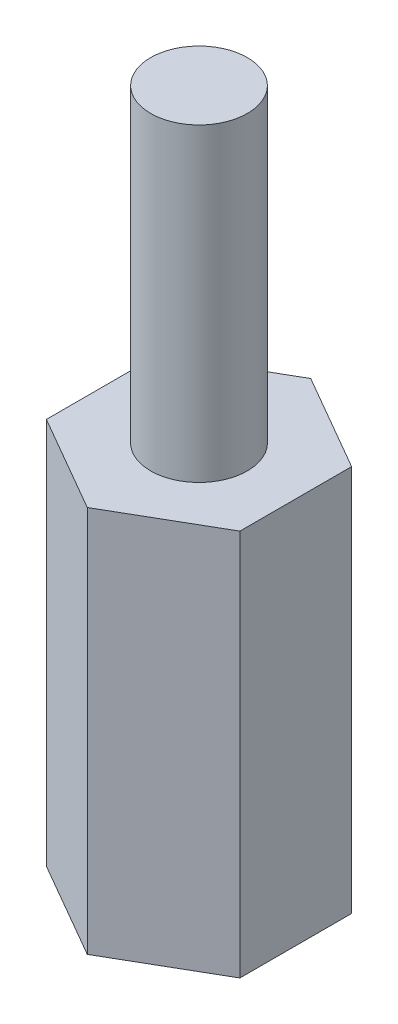
ISO-10303-21;
HEADER;
FILE_DESCRIPTION(('STEP AP214'),'2;1');
FILE_NAME('part.step','',(''),(''),'','','');
FILE_SCHEMA(('AUTOMOTIVE_DESIGN { 1 0 10303 214 1 1 1 1 }'));
ENDSEC;
DATA;
#1=APPLICATION_CONTEXT('core data for automotive mechanical design processes');
#2=APPLICATION_PROTOCOL_DEFINITION('international standard','automotive_design',2000,#1);
#3=PRODUCT_CONTEXT('',#1,'mechanical');
#4=PRODUCT('Part','Part','',(#3));
#5=PRODUCT_RELATED_PRODUCT_CATEGORY('part','',(#4));
#6=PRODUCT_DEFINITION_FORMATION('','',#4);
#7=PRODUCT_DEFINITION_CONTEXT('part definition',#1,'design');
#8=PRODUCT_DEFINITION('design','',#6,#7);
#9=PRODUCT_DEFINITION_SHAPE('','',#8);
#10=(LENGTH_UNIT() NAMED_UNIT(*) SI_UNIT(.MILLI.,.METRE.));
#11=(NAMED_UNIT(*) PLANE_ANGLE_UNIT() SI_UNIT($,.RADIAN.));
#12=(NAMED_UNIT(*) SI_UNIT($,.STERADIAN.) SOLID_ANGLE_UNIT());
#13=UNCERTAINTY_MEASURE_WITH_UNIT(LENGTH_MEASURE(1.E-05),#10,'distance_accuracy_value','');
#14=(GEOMETRIC_REPRESENTATION_CONTEXT(3) GLOBAL_UNCERTAINTY_ASSIGNED_CONTEXT((#13)) GLOBAL_UNIT_ASSIGNED_CONTEXT((#10,
#11,#12)) REPRESENTATION_CONTEXT('',''));
#15=CARTESIAN_POINT('',(0.,0.,0.));
#16=DIRECTION('',(0.,0.,1.));
#17=DIRECTION('',(1.,0.,0.));
#18=AXIS2_PLACEMENT_3D('',#15,#16,#17);
#19=CARTESIAN_POINT('',(2.49999999999999,10.,-1.4433756729741));
#20=DIRECTION('',(-0.499999999999995,0.,0.866025403784442));
#21=DIRECTION('',(0.866025403784442,0.,0.499999999999995));
#22=AXIS2_PLACEMENT_3D('',#19,#20,#21);
#23=PLANE('',#22);
#24=DIRECTION('',(-0.866025403784442,0.,-0.499999999999995));
#25=VECTOR('',#24,1.);
#26=CARTESIAN_POINT('',(2.49999999999999,0.,-1.4433756729741));
#27=LINE('',#26,#25);
#28=CARTESIAN_POINT('',(2.49999999999999,0.,-1.4433756729741));
#29=VERTEX_POINT('',#28);
#30=CARTESIAN_POINT('',(0.,0.,-2.88675134594814));
#31=VERTEX_POINT('',#30);
#32=EDGE_CURVE('E130',#29,#31,#27,.T.);
#33=ORIENTED_EDGE('',*,*,#32,.T.);
#34=DIRECTION('',(0.,-1.,0.));
#35=VECTOR('',#34,1.);
#36=CARTESIAN_POINT('',(0.,10.,-2.88675134594814));
#37=LINE('',#36,#35);
#38=CARTESIAN_POINT('',(0.,10.,-2.88675134594814));
#39=VERTEX_POINT('',#38);
#40=EDGE_CURVE('E42',#39,#31,#37,.T.);
#41=ORIENTED_EDGE('',*,*,#40,.F.);
#42=DIRECTION('',(-0.866025403784442,0.,-0.499999999999995));
#43=VECTOR('',#42,1.);
#44=CARTESIAN_POINT('',(2.49999999999999,10.,-1.4433756729741));
#45=LINE('',#44,#43);
#46=CARTESIAN_POINT('',(2.49999999999999,10.,-1.4433756729741));
#47=VERTEX_POINT('',#46);
#48=EDGE_CURVE('E147',#47,#39,#45,.T.);
#49=ORIENTED_EDGE('',*,*,#48,.F.);
#50=DIRECTION('',(0.,-1.,0.));
#51=VECTOR('',#50,1.);
#52=CARTESIAN_POINT('',(2.49999999999999,10.,-1.4433756729741));
#53=LINE('',#52,#51);
#54=EDGE_CURVE('E126',#47,#29,#53,.T.);
#55=ORIENTED_EDGE('',*,*,#54,.T.);
#56=EDGE_LOOP('',(#33,#41,#49,#55));
#57=FACE_BOUND('',#56,.T.);
#58=ADVANCED_FACE('F39',(#57),#23,.F.);
#59=CARTESIAN_POINT('',(0.,10.,-2.88675134594814));
#60=DIRECTION('',(0.500000000000001,0.,0.866025403784438));
#61=DIRECTION('',(0.866025403784438,0.,-0.500000000000001));
#62=AXIS2_PLACEMENT_3D('',#59,#60,#61);
#63=PLANE('',#62);
#64=DIRECTION('',(-0.866025403784438,0.,0.500000000000001));
#65=VECTOR('',#64,1.);
#66=CARTESIAN_POINT('',(0.,0.,-2.88675134594814));
#67=LINE('',#66,#65);
#68=CARTESIAN_POINT('',(-2.50000000000001,0.,-1.44337567297406));
#69=VERTEX_POINT('',#68);
#70=EDGE_CURVE('E134',#31,#69,#67,.T.);
#71=ORIENTED_EDGE('',*,*,#70,.T.);
#72=DIRECTION('',(0.,-1.,0.));
#73=VECTOR('',#72,1.);
#74=CARTESIAN_POINT('',(-2.50000000000001,10.,-1.44337567297406));
#75=LINE('',#74,#73);
#76=CARTESIAN_POINT('',(-2.50000000000001,10.,-1.44337567297406));
#77=VERTEX_POINT('',#76);
#78=EDGE_CURVE('E153',#77,#69,#75,.T.);
#79=ORIENTED_EDGE('',*,*,#78,.F.);
#80=DIRECTION('',(-0.866025403784438,0.,0.500000000000001));
#81=VECTOR('',#80,1.);
#82=CARTESIAN_POINT('',(0.,10.,-2.88675134594814));
#83=LINE('',#82,#81);
#84=EDGE_CURVE('E95',#39,#77,#83,.T.);
#85=ORIENTED_EDGE('',*,*,#84,.F.);
#86=ORIENTED_EDGE('',*,*,#40,.T.);
#87=EDGE_LOOP('',(#71,#79,#85,#86));
#88=FACE_BOUND('',#87,.T.);
#89=ADVANCED_FACE('F160',(#88),#63,.F.);
#90=CARTESIAN_POINT('',(-2.50000000000001,10.,-1.44337567297406));
#91=DIRECTION('',(1.,0.,0.));
#92=DIRECTION('',(0.,0.,-1.));
#93=AXIS2_PLACEMENT_3D('',#90,#91,#92);
#94=PLANE('',#93);
#95=DIRECTION('',(0.,0.,1.));
#96=VECTOR('',#95,1.);
#97=CARTESIAN_POINT('',(-2.50000000000001,0.,-1.44337567297406));
#98=LINE('',#97,#96);
#99=CARTESIAN_POINT('',(-2.5,0.,1.44337567297408));
#100=VERTEX_POINT('',#99);
#101=EDGE_CURVE('E138',#69,#100,#98,.T.);
#102=ORIENTED_EDGE('',*,*,#101,.T.);
#103=DIRECTION('',(0.,-1.,0.));
#104=VECTOR('',#103,1.);
#105=CARTESIAN_POINT('',(-2.5,10.,1.44337567297408));
#106=LINE('',#105,#104);
#107=CARTESIAN_POINT('',(-2.5,10.,1.44337567297408));
#108=VERTEX_POINT('',#107);
#109=EDGE_CURVE('E119',#108,#100,#106,.T.);
#110=ORIENTED_EDGE('',*,*,#109,.F.);
#111=DIRECTION('',(0.,0.,1.));
#112=VECTOR('',#111,1.);
#113=CARTESIAN_POINT('',(-2.50000000000001,10.,-1.44337567297406));
#114=LINE('',#113,#112);
#115=EDGE_CURVE('E108',#77,#108,#114,.T.);
#116=ORIENTED_EDGE('',*,*,#115,.F.);
#117=ORIENTED_EDGE('',*,*,#78,.T.);
#118=EDGE_LOOP('',(#102,#110,#116,#117));
#119=FACE_BOUND('',#118,.T.);
#120=ADVANCED_FACE('F166',(#119),#94,.F.);
#121=CARTESIAN_POINT('',(-2.5,10.,1.44337567297408));
#122=DIRECTION('',(0.499999999999995,0.,-0.866025403784442));
#123=DIRECTION('',(-0.866025403784442,0.,-0.499999999999995));
#124=AXIS2_PLACEMENT_3D('',#121,#122,#123);
#125=PLANE('',#124);
#126=DIRECTION('',(0.866025403784442,0.,0.499999999999995));
#127=VECTOR('',#126,1.);
#128=CARTESIAN_POINT('',(-2.5,0.,1.44337567297408));
#129=LINE('',#128,#127);
#130=CARTESIAN_POINT('',(0.,0.,2.88675134594814));
#131=VERTEX_POINT('',#130);
#132=EDGE_CURVE('E117',#100,#131,#129,.T.);
#133=ORIENTED_EDGE('',*,*,#132,.T.);
#134=DIRECTION('',(0.,-1.,0.));
#135=VECTOR('',#134,1.);
#136=CARTESIAN_POINT('',(0.,10.,2.88675134594814));
#137=LINE('',#136,#135);
#138=CARTESIAN_POINT('',(0.,10.,2.88675134594814));
#139=VERTEX_POINT('',#138);
#140=EDGE_CURVE('E114',#139,#131,#137,.T.);
#141=ORIENTED_EDGE('',*,*,#140,.F.);
#142=DIRECTION('',(0.866025403784442,0.,0.499999999999995));
#143=VECTOR('',#142,1.);
#144=CARTESIAN_POINT('',(-2.5,10.,1.44337567297408));
#145=LINE('',#144,#143);
#146=EDGE_CURVE('E102',#108,#139,#145,.T.);
#147=ORIENTED_EDGE('',*,*,#146,.F.);
#148=ORIENTED_EDGE('',*,*,#109,.T.);
#149=EDGE_LOOP('',(#133,#141,#147,#148));
#150=FACE_BOUND('',#149,.T.);
#151=ADVANCED_FACE('F115',(#150),#125,.F.);
#152=CARTESIAN_POINT('',(0.,10.,2.88675134594814));
#153=DIRECTION('',(-0.500000000000007,0.,-0.866025403784435));
#154=DIRECTION('',(-0.866025403784435,0.,0.500000000000007));
#155=AXIS2_PLACEMENT_3D('',#152,#153,#154);
#156=PLANE('',#155);
#157=DIRECTION('',(0.866025403784435,0.,-0.500000000000007));
#158=VECTOR('',#157,1.);
#159=CARTESIAN_POINT('',(0.,0.,2.88675134594814));
#160=LINE('',#159,#158);
#161=CARTESIAN_POINT('',(2.50000000000002,0.,1.44337567297405));
#162=VERTEX_POINT('',#161);
#163=EDGE_CURVE('E80',#131,#162,#160,.T.);
#164=ORIENTED_EDGE('',*,*,#163,.T.);
#165=DIRECTION('',(0.,-1.,0.));
#166=VECTOR('',#165,1.);
#167=CARTESIAN_POINT('',(2.50000000000002,10.,1.44337567297405));
#168=LINE('',#167,#166);
#169=CARTESIAN_POINT('',(2.50000000000002,10.,1.44337567297405));
#170=VERTEX_POINT('',#169);
#171=EDGE_CURVE('E120',#170,#162,#168,.T.);
#172=ORIENTED_EDGE('',*,*,#171,.F.);
#173=DIRECTION('',(0.866025403784435,0.,-0.500000000000007));
#174=VECTOR('',#173,1.);
#175=CARTESIAN_POINT('',(0.,10.,2.88675134594814));
#176=LINE('',#175,#174);
#177=EDGE_CURVE('E106',#139,#170,#176,.T.);
#178=ORIENTED_EDGE('',*,*,#177,.F.);
#179=ORIENTED_EDGE('',*,*,#140,.T.);
#180=EDGE_LOOP('',(#164,#172,#178,#179));
#181=FACE_BOUND('',#180,.T.);
#182=ADVANCED_FACE('F122',(#181),#156,.F.);
#183=CARTESIAN_POINT('',(2.50000000000002,10.,1.44337567297405));
#184=DIRECTION('',(-1.,0.,0.));
#185=DIRECTION('',(0.,0.,1.));
#186=AXIS2_PLACEMENT_3D('',#183,#184,#185);
#187=PLANE('',#186);
#188=DIRECTION('',(0.,0.,-1.));
#189=VECTOR('',#188,1.);
#190=CARTESIAN_POINT('',(2.50000000000002,0.,1.44337567297405));
#191=LINE('',#190,#189);
#192=EDGE_CURVE('E86',#162,#29,#191,.T.);
#193=ORIENTED_EDGE('',*,*,#192,.T.);
#194=ORIENTED_EDGE('',*,*,#54,.F.);
#195=DIRECTION('',(0.,0.,-1.));
#196=VECTOR('',#195,1.);
#197=CARTESIAN_POINT('',(2.50000000000002,10.,1.44337567297405));
#198=LINE('',#197,#196);
#199=EDGE_CURVE('E57',#170,#47,#198,.T.);
#200=ORIENTED_EDGE('',*,*,#199,.F.);
#201=ORIENTED_EDGE('',*,*,#171,.T.);
#202=EDGE_LOOP('',(#193,#194,#200,#201));
#203=FACE_BOUND('',#202,.T.);
#204=ADVANCED_FACE('F203',(#203),#187,.F.);
#205=CARTESIAN_POINT('',(0.,10.,0.));
#206=DIRECTION('',(0.,1.,0.));
#207=DIRECTION('',(0.,0.,1.));
#208=AXIS2_PLACEMENT_3D('',#205,#206,#207);
#209=PLANE('',#208);
#210=CARTESIAN_POINT('',(0.,10.,0.));
#211=DIRECTION('',(0.,1.,0.));
#212=DIRECTION('',(0.,0.,1.));
#213=AXIS2_PLACEMENT_3D('',#210,#211,#212);
#214=CIRCLE('',#213,1.25);
#215=CARTESIAN_POINT('',(0.,10.,1.25));
#216=VERTEX_POINT('',#215);
#217=EDGE_CURVE('E11',#216,#216,#214,.T.);
#218=ORIENTED_EDGE('',*,*,#217,.F.);
#219=EDGE_LOOP('',(#218));
#220=FACE_BOUND('',#219,.T.);
#221=ORIENTED_EDGE('',*,*,#48,.T.);
#222=ORIENTED_EDGE('',*,*,#84,.T.);
#223=ORIENTED_EDGE('',*,*,#115,.T.);
#224=ORIENTED_EDGE('',*,*,#146,.T.);
#225=ORIENTED_EDGE('',*,*,#177,.T.);
#226=ORIENTED_EDGE('',*,*,#199,.T.);
#227=EDGE_LOOP('',(#221,#222,#223,#224,#225,#226));
#228=FACE_BOUND('',#227,.T.);
#229=ADVANCED_FACE('F104',(#220,#228),#209,.T.);
#230=CARTESIAN_POINT('',(0.,0.,0.));
#231=DIRECTION('',(0.,1.,0.));
#232=DIRECTION('',(0.,0.,1.));
#233=AXIS2_PLACEMENT_3D('',#230,#231,#232);
#234=PLANE('',#233);
#235=CARTESIAN_POINT('',(0.,0.,0.));
#236=DIRECTION('',(0.,-1.,0.));
#237=DIRECTION('',(0.,0.,-1.));
#238=AXIS2_PLACEMENT_3D('',#235,#236,#237);
#239=CIRCLE('',#238,1.25);
#240=CARTESIAN_POINT('',(0.,0.,-1.25));
#241=VERTEX_POINT('',#240);
#242=EDGE_CURVE('E177',#241,#241,#239,.T.);
#243=ORIENTED_EDGE('',*,*,#242,.F.);
#244=EDGE_LOOP('',(#243));
#245=FACE_BOUND('',#244,.T.);
#246=ORIENTED_EDGE('',*,*,#32,.F.);
#247=ORIENTED_EDGE('',*,*,#192,.F.);
#248=ORIENTED_EDGE('',*,*,#163,.F.);
#249=ORIENTED_EDGE('',*,*,#132,.F.);
#250=ORIENTED_EDGE('',*,*,#101,.F.);
#251=ORIENTED_EDGE('',*,*,#70,.F.);
#252=EDGE_LOOP('',(#246,#247,#248,#249,#250,#251));
#253=FACE_BOUND('',#252,.T.);
#254=ADVANCED_FACE('F165',(#245,#253),#234,.F.);
#255=CARTESIAN_POINT('',(0.,18.,0.));
#256=DIRECTION('',(0.,-1.,0.));
#257=DIRECTION('',(0.,0.,-1.));
#258=AXIS2_PLACEMENT_3D('',#255,#256,#257);
#259=CYLINDRICAL_SURFACE('',#258,1.25);
#260=CARTESIAN_POINT('',(0.,18.,0.));
#261=DIRECTION('',(0.,1.,0.));
#262=DIRECTION('',(0.,0.,1.));
#263=AXIS2_PLACEMENT_3D('',#260,#261,#262);
#264=CIRCLE('',#263,1.25);
#265=CARTESIAN_POINT('',(0.,18.,1.25));
#266=VERTEX_POINT('',#265);
#267=EDGE_CURVE('E135',#266,#266,#264,.T.);
#268=ORIENTED_EDGE('',*,*,#267,.F.);
#269=EDGE_LOOP('',(#268));
#270=FACE_BOUND('',#269,.T.);
#271=ORIENTED_EDGE('',*,*,#217,.T.);
#272=EDGE_LOOP('',(#271));
#273=FACE_BOUND('',#272,.T.);
#274=ADVANCED_FACE('F195',(#270,#273),#259,.T.);
#275=CARTESIAN_POINT('',(0.,18.,0.));
#276=DIRECTION('',(0.,1.,0.));
#277=DIRECTION('',(0.,0.,1.));
#278=AXIS2_PLACEMENT_3D('',#275,#276,#277);
#279=PLANE('',#278);
#280=ORIENTED_EDGE('',*,*,#267,.T.);
#281=EDGE_LOOP('',(#280));
#282=FACE_BOUND('',#281,.T.);
#283=ADVANCED_FACE('F190',(#282),#279,.T.);
#284=CARTESIAN_POINT('',(0.,8.,0.));
#285=DIRECTION('',(0.,-1.,0.));
#286=DIRECTION('',(0.,0.,-1.));
#287=AXIS2_PLACEMENT_3D('',#284,#285,#286);
#288=CYLINDRICAL_SURFACE('',#287,1.25);
#289=CARTESIAN_POINT('',(0.,8.,0.));
#290=DIRECTION('',(0.,-1.,0.));
#291=DIRECTION('',(0.,0.,-1.));
#292=AXIS2_PLACEMENT_3D('',#289,#290,#291);
#293=CIRCLE('',#292,1.25);
#294=CARTESIAN_POINT('',(0.,8.,-1.25));
#295=VERTEX_POINT('',#294);
#296=EDGE_CURVE('E176',#295,#295,#293,.T.);
#297=ORIENTED_EDGE('',*,*,#296,.F.);
#298=EDGE_LOOP('',(#297));
#299=FACE_BOUND('',#298,.T.);
#300=ORIENTED_EDGE('',*,*,#242,.T.);
#301=EDGE_LOOP('',(#300));
#302=FACE_BOUND('',#301,.T.);
#303=ADVANCED_FACE('F187',(#299,#302),#288,.F.);
#304=CARTESIAN_POINT('',(0.,8.,0.));
#305=DIRECTION('',(0.,-1.,0.));
#306=DIRECTION('',(0.,0.,-1.));
#307=AXIS2_PLACEMENT_3D('',#304,#305,#306);
#308=PLANE('',#307);
#309=ORIENTED_EDGE('',*,*,#296,.T.);
#310=EDGE_LOOP('',(#309));
#311=FACE_BOUND('',#310,.T.);
#312=ADVANCED_FACE('F185',(#311),#308,.T.);
#313=CLOSED_SHELL('',(#58,#89,#120,#151,#182,#204,#229,#254,#274,#283,#303,#312));
#314=MANIFOLD_SOLID_BREP('B2',#313);
#315=ADVANCED_BREP_SHAPE_REPRESENTATION('',(#18,#314),#14);
#316=SHAPE_DEFINITION_REPRESENTATION(#9,#315);
ENDSEC;
END-ISO-10303-21;
